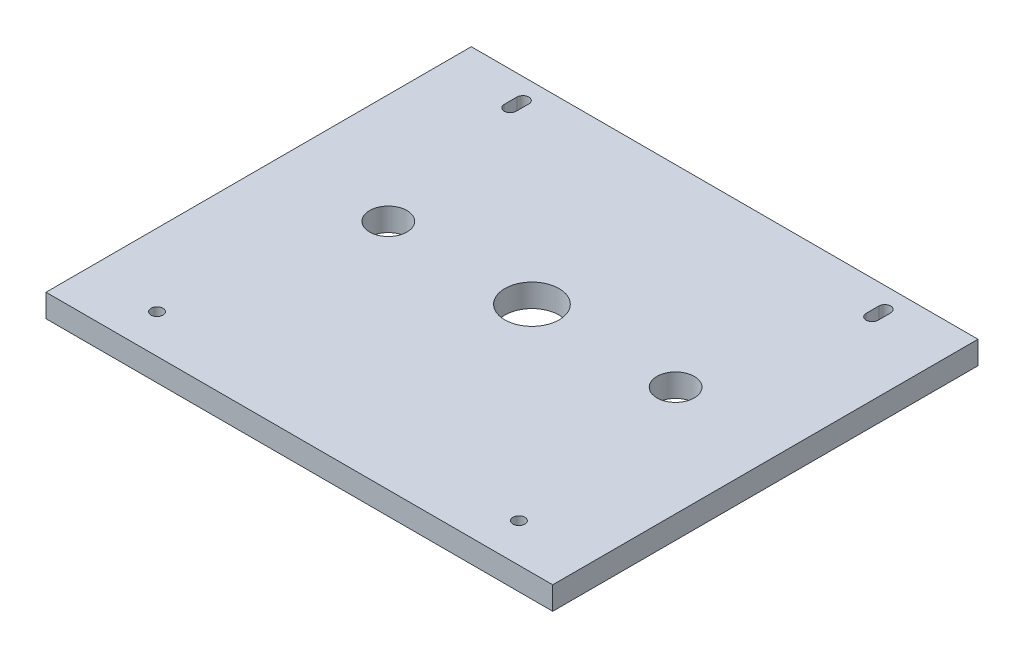
ISO-10303-21;
HEADER;
FILE_DESCRIPTION(('STEP AP214'),'2;1');
FILE_NAME('part.step','',(''),(''),'','','');
FILE_SCHEMA(('AUTOMOTIVE_DESIGN { 1 0 10303 214 1 1 1 1 }'));
ENDSEC;
DATA;
#1=APPLICATION_CONTEXT('core data for automotive mechanical design processes');
#2=APPLICATION_PROTOCOL_DEFINITION('international standard','automotive_design',2000,#1);
#3=PRODUCT_CONTEXT('',#1,'mechanical');
#4=PRODUCT('Part','Part','',(#3));
#5=PRODUCT_RELATED_PRODUCT_CATEGORY('part','',(#4));
#6=PRODUCT_DEFINITION_FORMATION('','',#4);
#7=PRODUCT_DEFINITION_CONTEXT('part definition',#1,'design');
#8=PRODUCT_DEFINITION('design','',#6,#7);
#9=PRODUCT_DEFINITION_SHAPE('','',#8);
#10=(LENGTH_UNIT() NAMED_UNIT(*) SI_UNIT(.MILLI.,.METRE.));
#11=(NAMED_UNIT(*) PLANE_ANGLE_UNIT() SI_UNIT($,.RADIAN.));
#12=(NAMED_UNIT(*) SI_UNIT($,.STERADIAN.) SOLID_ANGLE_UNIT());
#13=UNCERTAINTY_MEASURE_WITH_UNIT(LENGTH_MEASURE(1.E-05),#10,'distance_accuracy_value','');
#14=(GEOMETRIC_REPRESENTATION_CONTEXT(3) GLOBAL_UNCERTAINTY_ASSIGNED_CONTEXT((#13)) GLOBAL_UNIT_ASSIGNED_CONTEXT((#10,
#11,#12)) REPRESENTATION_CONTEXT('',''));
#15=CARTESIAN_POINT('',(0.,0.,0.));
#16=DIRECTION('',(0.,0.,1.));
#17=DIRECTION('',(1.,0.,0.));
#18=AXIS2_PLACEMENT_3D('',#15,#16,#17);
#19=CARTESIAN_POINT('',(0.,6.35,0.));
#20=DIRECTION('',(1.,0.,0.));
#21=DIRECTION('',(0.,0.,-1.));
#22=AXIS2_PLACEMENT_3D('',#19,#20,#21);
#23=PLANE('',#22);
#24=DIRECTION('',(0.,0.,1.));
#25=VECTOR('',#24,1.);
#26=CARTESIAN_POINT('',(0.,0.,0.));
#27=LINE('',#26,#25);
#28=CARTESIAN_POINT('',(0.,0.,-117.505));
#29=VERTEX_POINT('',#28);
#30=CARTESIAN_POINT('',(0.,0.,0.));
#31=VERTEX_POINT('',#30);
#32=EDGE_CURVE('E222',#29,#31,#27,.T.);
#33=ORIENTED_EDGE('',*,*,#32,.T.);
#34=DIRECTION('',(0.,-1.,0.));
#35=VECTOR('',#34,1.);
#36=CARTESIAN_POINT('',(0.,6.35,0.));
#37=LINE('',#36,#35);
#38=CARTESIAN_POINT('',(0.,6.35,0.));
#39=VERTEX_POINT('',#38);
#40=EDGE_CURVE('E11',#39,#31,#37,.T.);
#41=ORIENTED_EDGE('',*,*,#40,.F.);
#42=DIRECTION('',(0.,0.,1.));
#43=VECTOR('',#42,1.);
#44=CARTESIAN_POINT('',(0.,6.35,0.));
#45=LINE('',#44,#43);
#46=CARTESIAN_POINT('',(0.,6.35,-117.505));
#47=VERTEX_POINT('',#46);
#48=EDGE_CURVE('E225',#47,#39,#45,.T.);
#49=ORIENTED_EDGE('',*,*,#48,.F.);
#50=DIRECTION('',(0.,-1.,0.));
#51=VECTOR('',#50,1.);
#52=CARTESIAN_POINT('',(0.,6.35,-117.505));
#53=LINE('',#52,#51);
#54=EDGE_CURVE('E235',#47,#29,#53,.T.);
#55=ORIENTED_EDGE('',*,*,#54,.T.);
#56=EDGE_LOOP('',(#33,#41,#49,#55));
#57=FACE_BOUND('',#56,.T.);
#58=ADVANCED_FACE('F41',(#57),#23,.F.);
#59=CARTESIAN_POINT('',(0.,6.35,0.));
#60=DIRECTION('',(0.,0.,-1.));
#61=DIRECTION('',(-1.,0.,0.));
#62=AXIS2_PLACEMENT_3D('',#59,#60,#61);
#63=PLANE('',#62);
#64=DIRECTION('',(1.,0.,0.));
#65=VECTOR('',#64,1.);
#66=CARTESIAN_POINT('',(0.,0.,0.));
#67=LINE('',#66,#65);
#68=CARTESIAN_POINT('',(140.,0.,0.));
#69=VERTEX_POINT('',#68);
#70=EDGE_CURVE('E238',#31,#69,#67,.T.);
#71=ORIENTED_EDGE('',*,*,#70,.T.);
#72=DIRECTION('',(0.,-1.,0.));
#73=VECTOR('',#72,1.);
#74=CARTESIAN_POINT('',(140.,6.35,0.));
#75=LINE('',#74,#73);
#76=CARTESIAN_POINT('',(140.,6.35,0.));
#77=VERTEX_POINT('',#76);
#78=EDGE_CURVE('E48',#77,#69,#75,.T.);
#79=ORIENTED_EDGE('',*,*,#78,.F.);
#80=DIRECTION('',(1.,0.,0.));
#81=VECTOR('',#80,1.);
#82=CARTESIAN_POINT('',(0.,6.35,0.));
#83=LINE('',#82,#81);
#84=EDGE_CURVE('E228',#39,#77,#83,.T.);
#85=ORIENTED_EDGE('',*,*,#84,.F.);
#86=ORIENTED_EDGE('',*,*,#40,.T.);
#87=EDGE_LOOP('',(#71,#79,#85,#86));
#88=FACE_BOUND('',#87,.T.);
#89=ADVANCED_FACE('F267',(#88),#63,.F.);
#90=CARTESIAN_POINT('',(140.,6.35,0.));
#91=DIRECTION('',(-1.,0.,0.));
#92=DIRECTION('',(0.,0.,1.));
#93=AXIS2_PLACEMENT_3D('',#90,#91,#92);
#94=PLANE('',#93);
#95=DIRECTION('',(0.,0.,-1.));
#96=VECTOR('',#95,1.);
#97=CARTESIAN_POINT('',(140.,0.,0.));
#98=LINE('',#97,#96);
#99=CARTESIAN_POINT('',(140.,0.,-117.505));
#100=VERTEX_POINT('',#99);
#101=EDGE_CURVE('E240',#69,#100,#98,.T.);
#102=ORIENTED_EDGE('',*,*,#101,.T.);
#103=DIRECTION('',(0.,-1.,0.));
#104=VECTOR('',#103,1.);
#105=CARTESIAN_POINT('',(140.,6.35,-117.505));
#106=LINE('',#105,#104);
#107=CARTESIAN_POINT('',(140.,6.35,-117.505));
#108=VERTEX_POINT('',#107);
#109=EDGE_CURVE('E245',#108,#100,#106,.T.);
#110=ORIENTED_EDGE('',*,*,#109,.F.);
#111=DIRECTION('',(0.,0.,-1.));
#112=VECTOR('',#111,1.);
#113=CARTESIAN_POINT('',(140.,6.35,0.));
#114=LINE('',#113,#112);
#115=EDGE_CURVE('E231',#77,#108,#114,.T.);
#116=ORIENTED_EDGE('',*,*,#115,.F.);
#117=ORIENTED_EDGE('',*,*,#78,.T.);
#118=EDGE_LOOP('',(#102,#110,#116,#117));
#119=FACE_BOUND('',#118,.T.);
#120=ADVANCED_FACE('F252',(#119),#94,.F.);
#121=CARTESIAN_POINT('',(0.,6.35,-117.505));
#122=DIRECTION('',(0.,0.,1.));
#123=DIRECTION('',(1.,0.,0.));
#124=AXIS2_PLACEMENT_3D('',#121,#122,#123);
#125=PLANE('',#124);
#126=DIRECTION('',(-1.,0.,0.));
#127=VECTOR('',#126,1.);
#128=CARTESIAN_POINT('',(0.,0.,-117.505));
#129=LINE('',#128,#127);
#130=EDGE_CURVE('E229',#100,#29,#129,.T.);
#131=ORIENTED_EDGE('',*,*,#130,.T.);
#132=ORIENTED_EDGE('',*,*,#54,.F.);
#133=DIRECTION('',(-1.,0.,0.));
#134=VECTOR('',#133,1.);
#135=CARTESIAN_POINT('',(0.,6.35,-117.505));
#136=LINE('',#135,#134);
#137=EDGE_CURVE('E233',#108,#47,#136,.T.);
#138=ORIENTED_EDGE('',*,*,#137,.F.);
#139=ORIENTED_EDGE('',*,*,#109,.T.);
#140=EDGE_LOOP('',(#131,#132,#138,#139));
#141=FACE_BOUND('',#140,.T.);
#142=ADVANCED_FACE('F261',(#141),#125,.F.);
#143=CARTESIAN_POINT('',(0.,6.35,0.));
#144=DIRECTION('',(0.,-1.,0.));
#145=DIRECTION('',(0.,0.,-1.));
#146=AXIS2_PLACEMENT_3D('',#143,#144,#145);
#147=PLANE('',#146);
#148=DIRECTION('',(0.,0.,-1.));
#149=VECTOR('',#148,1.);
#150=CARTESIAN_POINT('',(121.65,6.35,-108.255));
#151=LINE('',#150,#149);
#152=CARTESIAN_POINT('',(121.65,6.35,-108.255));
#153=VERTEX_POINT('',#152);
#154=CARTESIAN_POINT('',(121.65,6.35,-111.755));
#155=VERTEX_POINT('',#154);
#156=EDGE_CURVE('E193',#153,#155,#151,.T.);
#157=ORIENTED_EDGE('',*,*,#156,.F.);
#158=CARTESIAN_POINT('',(120.,6.35,-108.255));
#159=DIRECTION('',(0.,1.,0.));
#160=DIRECTION('',(0.,0.,-1.));
#161=AXIS2_PLACEMENT_3D('',#158,#159,#160);
#162=CIRCLE('',#161,1.65);
#163=CARTESIAN_POINT('',(118.35,6.35,-108.255));
#164=VERTEX_POINT('',#163);
#165=EDGE_CURVE('E55',#164,#153,#162,.T.);
#166=ORIENTED_EDGE('',*,*,#165,.F.);
#167=DIRECTION('',(0.,0.,1.));
#168=VECTOR('',#167,1.);
#169=CARTESIAN_POINT('',(118.35,6.35,-108.255));
#170=LINE('',#169,#168);
#171=CARTESIAN_POINT('',(118.35,6.35,-111.755));
#172=VERTEX_POINT('',#171);
#173=EDGE_CURVE('E186',#172,#164,#170,.T.);
#174=ORIENTED_EDGE('',*,*,#173,.F.);
#175=CARTESIAN_POINT('',(120.,6.35,-111.755));
#176=DIRECTION('',(0.,1.,0.));
#177=DIRECTION('',(0.,0.,-1.));
#178=AXIS2_PLACEMENT_3D('',#175,#176,#177);
#179=CIRCLE('',#178,1.65);
#180=EDGE_CURVE('E189',#155,#172,#179,.T.);
#181=ORIENTED_EDGE('',*,*,#180,.F.);
#182=EDGE_LOOP('',(#157,#166,#174,#181));
#183=FACE_BOUND('',#182,.T.);
#184=CARTESIAN_POINT('',(109.6875,6.35,-64.265));
#185=DIRECTION('',(0.,1.,0.));
#186=DIRECTION('',(0.,0.,-1.));
#187=AXIS2_PLACEMENT_3D('',#184,#185,#186);
#188=CIRCLE('',#187,5.16000000000002);
#189=CARTESIAN_POINT('',(109.6875,6.35,-69.425));
#190=VERTEX_POINT('',#189);
#191=EDGE_CURVE('E173',#190,#190,#188,.T.);
#192=ORIENTED_EDGE('',*,*,#191,.F.);
#193=EDGE_LOOP('',(#192));
#194=FACE_BOUND('',#193,.T.);
#195=CARTESIAN_POINT('',(120.,6.35,-10.675));
#196=DIRECTION('',(0.,1.,0.));
#197=DIRECTION('',(0.,0.,-1.));
#198=AXIS2_PLACEMENT_3D('',#195,#196,#197);
#199=CIRCLE('',#198,1.65);
#200=CARTESIAN_POINT('',(120.,6.35,-12.325));
#201=VERTEX_POINT('',#200);
#202=EDGE_CURVE('E214',#201,#201,#199,.T.);
#203=ORIENTED_EDGE('',*,*,#202,.F.);
#204=EDGE_LOOP('',(#203));
#205=FACE_BOUND('',#204,.T.);
#206=CARTESIAN_POINT('',(30.3125,6.35,-64.265));
#207=DIRECTION('',(0.,1.,0.));
#208=DIRECTION('',(0.,0.,1.));
#209=AXIS2_PLACEMENT_3D('',#206,#207,#208);
#210=CIRCLE('',#209,5.16000000000001);
#211=CARTESIAN_POINT('',(30.3125,6.35,-59.105));
#212=VERTEX_POINT('',#211);
#213=EDGE_CURVE('E207',#212,#212,#210,.T.);
#214=ORIENTED_EDGE('',*,*,#213,.F.);
#215=EDGE_LOOP('',(#214));
#216=FACE_BOUND('',#215,.T.);
#217=DIRECTION('',(0.,0.,-1.));
#218=VECTOR('',#217,1.);
#219=CARTESIAN_POINT('',(21.6499999999999,6.35,-108.255));
#220=LINE('',#219,#218);
#221=CARTESIAN_POINT('',(21.6499999999999,6.35,-108.255));
#222=VERTEX_POINT('',#221);
#223=CARTESIAN_POINT('',(21.6499999999999,6.35,-111.755));
#224=VERTEX_POINT('',#223);
#225=EDGE_CURVE('E150',#222,#224,#220,.T.);
#226=ORIENTED_EDGE('',*,*,#225,.F.);
#227=CARTESIAN_POINT('',(19.9999999999999,6.35,-108.255));
#228=DIRECTION('',(0.,1.,0.));
#229=DIRECTION('',(0.,0.,1.));
#230=AXIS2_PLACEMENT_3D('',#227,#228,#229);
#231=CIRCLE('',#230,1.65);
#232=CARTESIAN_POINT('',(18.3499999999999,6.35,-108.255));
#233=VERTEX_POINT('',#232);
#234=EDGE_CURVE('E63',#233,#222,#231,.T.);
#235=ORIENTED_EDGE('',*,*,#234,.F.);
#236=DIRECTION('',(0.,0.,1.));
#237=VECTOR('',#236,1.);
#238=CARTESIAN_POINT('',(18.3499999999999,6.35,-108.255));
#239=LINE('',#238,#237);
#240=CARTESIAN_POINT('',(18.3499999999999,6.35,-111.755));
#241=VERTEX_POINT('',#240);
#242=EDGE_CURVE('E139',#241,#233,#239,.T.);
#243=ORIENTED_EDGE('',*,*,#242,.F.);
#244=CARTESIAN_POINT('',(19.9999999999999,6.35,-111.755));
#245=DIRECTION('',(0.,1.,0.));
#246=DIRECTION('',(0.,0.,1.));
#247=AXIS2_PLACEMENT_3D('',#244,#245,#246);
#248=CIRCLE('',#247,1.65);
#249=EDGE_CURVE('E144',#224,#241,#248,.T.);
#250=ORIENTED_EDGE('',*,*,#249,.F.);
#251=EDGE_LOOP('',(#226,#235,#243,#250));
#252=FACE_BOUND('',#251,.T.);
#253=CARTESIAN_POINT('',(70.,6.35,-64.265));
#254=DIRECTION('',(0.,1.,0.));
#255=DIRECTION('',(0.,0.,1.));
#256=AXIS2_PLACEMENT_3D('',#253,#254,#255);
#257=CIRCLE('',#256,7.50000000000001);
#258=CARTESIAN_POINT('',(70.,6.35,-56.765));
#259=VERTEX_POINT('',#258);
#260=EDGE_CURVE('E136',#259,#259,#257,.T.);
#261=ORIENTED_EDGE('',*,*,#260,.F.);
#262=EDGE_LOOP('',(#261));
#263=FACE_BOUND('',#262,.T.);
#264=CARTESIAN_POINT('',(20.,6.35,-10.675));
#265=DIRECTION('',(0.,1.,0.));
#266=DIRECTION('',(0.,0.,1.));
#267=AXIS2_PLACEMENT_3D('',#264,#265,#266);
#268=CIRCLE('',#267,1.65);
#269=CARTESIAN_POINT('',(20.,6.35,-9.025));
#270=VERTEX_POINT('',#269);
#271=EDGE_CURVE('E210',#270,#270,#268,.T.);
#272=ORIENTED_EDGE('',*,*,#271,.F.);
#273=EDGE_LOOP('',(#272));
#274=FACE_BOUND('',#273,.T.);
#275=ORIENTED_EDGE('',*,*,#48,.T.);
#276=ORIENTED_EDGE('',*,*,#84,.T.);
#277=ORIENTED_EDGE('',*,*,#115,.T.);
#278=ORIENTED_EDGE('',*,*,#137,.T.);
#279=EDGE_LOOP('',(#275,#276,#277,#278));
#280=FACE_BOUND('',#279,.T.);
#281=ADVANCED_FACE('F147',(#183,#194,#205,#216,#252,#263,#274,#280),#147,.F.);
#282=CARTESIAN_POINT('',(0.,0.,0.));
#283=DIRECTION('',(0.,-1.,0.));
#284=DIRECTION('',(0.,0.,-1.));
#285=AXIS2_PLACEMENT_3D('',#282,#283,#284);
#286=PLANE('',#285);
#287=CARTESIAN_POINT('',(120.,0.,-108.255));
#288=DIRECTION('',(0.,1.,0.));
#289=DIRECTION('',(0.,0.,-1.));
#290=AXIS2_PLACEMENT_3D('',#287,#288,#289);
#291=CIRCLE('',#290,1.65);
#292=CARTESIAN_POINT('',(118.35,0.,-108.255));
#293=VERTEX_POINT('',#292);
#294=CARTESIAN_POINT('',(121.65,0.,-108.255));
#295=VERTEX_POINT('',#294);
#296=EDGE_CURVE('E190',#293,#295,#291,.T.);
#297=ORIENTED_EDGE('',*,*,#296,.T.);
#298=DIRECTION('',(0.,0.,-1.));
#299=VECTOR('',#298,1.);
#300=CARTESIAN_POINT('',(121.65,0.,-108.255));
#301=LINE('',#300,#299);
#302=CARTESIAN_POINT('',(121.65,0.,-111.755));
#303=VERTEX_POINT('',#302);
#304=EDGE_CURVE('E202',#295,#303,#301,.T.);
#305=ORIENTED_EDGE('',*,*,#304,.T.);
#306=CARTESIAN_POINT('',(120.,0.,-111.755));
#307=DIRECTION('',(0.,1.,0.));
#308=DIRECTION('',(0.,0.,-1.));
#309=AXIS2_PLACEMENT_3D('',#306,#307,#308);
#310=CIRCLE('',#309,1.65);
#311=CARTESIAN_POINT('',(118.35,0.,-111.755));
#312=VERTEX_POINT('',#311);
#313=EDGE_CURVE('E199',#303,#312,#310,.T.);
#314=ORIENTED_EDGE('',*,*,#313,.T.);
#315=DIRECTION('',(0.,0.,1.));
#316=VECTOR('',#315,1.);
#317=CARTESIAN_POINT('',(118.35,0.,-108.255));
#318=LINE('',#317,#316);
#319=EDGE_CURVE('E182',#312,#293,#318,.T.);
#320=ORIENTED_EDGE('',*,*,#319,.T.);
#321=EDGE_LOOP('',(#297,#305,#314,#320));
#322=FACE_BOUND('',#321,.T.);
#323=CARTESIAN_POINT('',(109.6875,0.,-64.265));
#324=DIRECTION('',(0.,1.,0.));
#325=DIRECTION('',(0.,0.,-1.));
#326=AXIS2_PLACEMENT_3D('',#323,#324,#325);
#327=CIRCLE('',#326,5.16000000000002);
#328=CARTESIAN_POINT('',(109.6875,0.,-69.425));
#329=VERTEX_POINT('',#328);
#330=EDGE_CURVE('E177',#329,#329,#327,.T.);
#331=ORIENTED_EDGE('',*,*,#330,.T.);
#332=EDGE_LOOP('',(#331));
#333=FACE_BOUND('',#332,.T.);
#334=CARTESIAN_POINT('',(120.,0.,-10.675));
#335=DIRECTION('',(0.,1.,0.));
#336=DIRECTION('',(0.,0.,-1.));
#337=AXIS2_PLACEMENT_3D('',#334,#335,#336);
#338=CIRCLE('',#337,1.65);
#339=CARTESIAN_POINT('',(120.,0.,-12.325));
#340=VERTEX_POINT('',#339);
#341=EDGE_CURVE('E176',#340,#340,#338,.T.);
#342=ORIENTED_EDGE('',*,*,#341,.T.);
#343=EDGE_LOOP('',(#342));
#344=FACE_BOUND('',#343,.T.);
#345=CARTESIAN_POINT('',(30.3125,0.,-64.265));
#346=DIRECTION('',(0.,1.,0.));
#347=DIRECTION('',(0.,0.,1.));
#348=AXIS2_PLACEMENT_3D('',#345,#346,#347);
#349=CIRCLE('',#348,5.16000000000001);
#350=CARTESIAN_POINT('',(30.3125,0.,-59.105));
#351=VERTEX_POINT('',#350);
#352=EDGE_CURVE('E211',#351,#351,#349,.T.);
#353=ORIENTED_EDGE('',*,*,#352,.T.);
#354=EDGE_LOOP('',(#353));
#355=FACE_BOUND('',#354,.T.);
#356=CARTESIAN_POINT('',(19.9999999999999,0.,-108.255));
#357=DIRECTION('',(0.,1.,0.));
#358=DIRECTION('',(0.,0.,1.));
#359=AXIS2_PLACEMENT_3D('',#356,#357,#358);
#360=CIRCLE('',#359,1.65);
#361=CARTESIAN_POINT('',(18.3499999999999,0.,-108.255));
#362=VERTEX_POINT('',#361);
#363=CARTESIAN_POINT('',(21.6499999999999,0.,-108.255));
#364=VERTEX_POINT('',#363);
#365=EDGE_CURVE('E131',#362,#364,#360,.T.);
#366=ORIENTED_EDGE('',*,*,#365,.T.);
#367=DIRECTION('',(0.,0.,-1.));
#368=VECTOR('',#367,1.);
#369=CARTESIAN_POINT('',(21.6499999999999,0.,-108.255));
#370=LINE('',#369,#368);
#371=CARTESIAN_POINT('',(21.6499999999999,0.,-111.755));
#372=VERTEX_POINT('',#371);
#373=EDGE_CURVE('E164',#364,#372,#370,.T.);
#374=ORIENTED_EDGE('',*,*,#373,.T.);
#375=CARTESIAN_POINT('',(19.9999999999999,0.,-111.755));
#376=DIRECTION('',(0.,1.,0.));
#377=DIRECTION('',(0.,0.,1.));
#378=AXIS2_PLACEMENT_3D('',#375,#376,#377);
#379=CIRCLE('',#378,1.65);
#380=CARTESIAN_POINT('',(18.3499999999999,0.,-111.755));
#381=VERTEX_POINT('',#380);
#382=EDGE_CURVE('E160',#372,#381,#379,.T.);
#383=ORIENTED_EDGE('',*,*,#382,.T.);
#384=DIRECTION('',(0.,0.,1.));
#385=VECTOR('',#384,1.);
#386=CARTESIAN_POINT('',(18.3499999999999,0.,-108.255));
#387=LINE('',#386,#385);
#388=EDGE_CURVE('E158',#381,#362,#387,.T.);
#389=ORIENTED_EDGE('',*,*,#388,.T.);
#390=EDGE_LOOP('',(#366,#374,#383,#389));
#391=FACE_BOUND('',#390,.T.);
#392=CARTESIAN_POINT('',(70.,0.,-64.265));
#393=DIRECTION('',(0.,1.,0.));
#394=DIRECTION('',(0.,0.,1.));
#395=AXIS2_PLACEMENT_3D('',#392,#393,#394);
#396=CIRCLE('',#395,7.50000000000001);
#397=CARTESIAN_POINT('',(70.,0.,-56.765));
#398=VERTEX_POINT('',#397);
#399=EDGE_CURVE('E170',#398,#398,#396,.T.);
#400=ORIENTED_EDGE('',*,*,#399,.T.);
#401=EDGE_LOOP('',(#400));
#402=FACE_BOUND('',#401,.T.);
#403=CARTESIAN_POINT('',(20.,0.,-10.675));
#404=DIRECTION('',(0.,1.,0.));
#405=DIRECTION('',(0.,0.,1.));
#406=AXIS2_PLACEMENT_3D('',#403,#404,#405);
#407=CIRCLE('',#406,1.65);
#408=CARTESIAN_POINT('',(20.,0.,-9.025));
#409=VERTEX_POINT('',#408);
#410=EDGE_CURVE('E219',#409,#409,#407,.T.);
#411=ORIENTED_EDGE('',*,*,#410,.T.);
#412=EDGE_LOOP('',(#411));
#413=FACE_BOUND('',#412,.T.);
#414=ORIENTED_EDGE('',*,*,#32,.F.);
#415=ORIENTED_EDGE('',*,*,#130,.F.);
#416=ORIENTED_EDGE('',*,*,#101,.F.);
#417=ORIENTED_EDGE('',*,*,#70,.F.);
#418=EDGE_LOOP('',(#414,#415,#416,#417));
#419=FACE_BOUND('',#418,.T.);
#420=ADVANCED_FACE('F258',(#322,#333,#344,#355,#391,#402,#413,#419),#286,.T.);
#421=CARTESIAN_POINT('',(20.,0.,-10.675));
#422=DIRECTION('',(0.,1.,0.));
#423=DIRECTION('',(0.,0.,1.));
#424=AXIS2_PLACEMENT_3D('',#421,#422,#423);
#425=CYLINDRICAL_SURFACE('',#424,1.65);
#426=ORIENTED_EDGE('',*,*,#410,.F.);
#427=EDGE_LOOP('',(#426));
#428=FACE_BOUND('',#427,.T.);
#429=ORIENTED_EDGE('',*,*,#271,.T.);
#430=EDGE_LOOP('',(#429));
#431=FACE_BOUND('',#430,.T.);
#432=ADVANCED_FACE('F279',(#428,#431),#425,.F.);
#433=CARTESIAN_POINT('',(70.,0.,-64.265));
#434=DIRECTION('',(0.,1.,0.));
#435=DIRECTION('',(0.,0.,1.));
#436=AXIS2_PLACEMENT_3D('',#433,#434,#435);
#437=CYLINDRICAL_SURFACE('',#436,7.50000000000001);
#438=ORIENTED_EDGE('',*,*,#399,.F.);
#439=EDGE_LOOP('',(#438));
#440=FACE_BOUND('',#439,.T.);
#441=ORIENTED_EDGE('',*,*,#260,.T.);
#442=EDGE_LOOP('',(#441));
#443=FACE_BOUND('',#442,.T.);
#444=ADVANCED_FACE('F286',(#440,#443),#437,.F.);
#445=CARTESIAN_POINT('',(19.9999999999999,0.,-108.255));
#446=DIRECTION('',(0.,1.,0.));
#447=DIRECTION('',(0.,0.,1.));
#448=AXIS2_PLACEMENT_3D('',#445,#446,#447);
#449=CYLINDRICAL_SURFACE('',#448,1.65);
#450=ORIENTED_EDGE('',*,*,#234,.T.);
#451=DIRECTION('',(0.,1.,0.));
#452=VECTOR('',#451,1.);
#453=CARTESIAN_POINT('',(21.6499999999999,0.,-108.255));
#454=LINE('',#453,#452);
#455=EDGE_CURVE('E161',#364,#222,#454,.T.);
#456=ORIENTED_EDGE('',*,*,#455,.F.);
#457=ORIENTED_EDGE('',*,*,#365,.F.);
#458=DIRECTION('',(0.,1.,0.));
#459=VECTOR('',#458,1.);
#460=CARTESIAN_POINT('',(18.3499999999999,0.,-108.255));
#461=LINE('',#460,#459);
#462=EDGE_CURVE('E127',#362,#233,#461,.T.);
#463=ORIENTED_EDGE('',*,*,#462,.T.);
#464=EDGE_LOOP('',(#450,#456,#457,#463));
#465=FACE_BOUND('',#464,.T.);
#466=ADVANCED_FACE('F129',(#465),#449,.F.);
#467=CARTESIAN_POINT('',(18.3499999999999,0.,-108.255));
#468=DIRECTION('',(-1.,0.,0.));
#469=DIRECTION('',(0.,0.,1.));
#470=AXIS2_PLACEMENT_3D('',#467,#468,#469);
#471=PLANE('',#470);
#472=ORIENTED_EDGE('',*,*,#242,.T.);
#473=ORIENTED_EDGE('',*,*,#462,.F.);
#474=ORIENTED_EDGE('',*,*,#388,.F.);
#475=DIRECTION('',(0.,1.,0.));
#476=VECTOR('',#475,1.);
#477=CARTESIAN_POINT('',(18.3499999999999,0.,-111.755));
#478=LINE('',#477,#476);
#479=EDGE_CURVE('E135',#381,#241,#478,.T.);
#480=ORIENTED_EDGE('',*,*,#479,.T.);
#481=EDGE_LOOP('',(#472,#473,#474,#480));
#482=FACE_BOUND('',#481,.T.);
#483=ADVANCED_FACE('F140',(#482),#471,.F.);
#484=CARTESIAN_POINT('',(19.9999999999999,0.,-111.755));
#485=DIRECTION('',(0.,1.,0.));
#486=DIRECTION('',(0.,0.,1.));
#487=AXIS2_PLACEMENT_3D('',#484,#485,#486);
#488=CYLINDRICAL_SURFACE('',#487,1.65);
#489=ORIENTED_EDGE('',*,*,#249,.T.);
#490=ORIENTED_EDGE('',*,*,#479,.F.);
#491=ORIENTED_EDGE('',*,*,#382,.F.);
#492=DIRECTION('',(0.,1.,0.));
#493=VECTOR('',#492,1.);
#494=CARTESIAN_POINT('',(21.6499999999999,0.,-111.755));
#495=LINE('',#494,#493);
#496=EDGE_CURVE('E443',#372,#224,#495,.T.);
#497=ORIENTED_EDGE('',*,*,#496,.T.);
#498=EDGE_LOOP('',(#489,#490,#491,#497));
#499=FACE_BOUND('',#498,.T.);
#500=ADVANCED_FACE('F321',(#499),#488,.F.);
#501=CARTESIAN_POINT('',(21.6499999999999,0.,-108.255));
#502=DIRECTION('',(1.,0.,0.));
#503=DIRECTION('',(0.,0.,-1.));
#504=AXIS2_PLACEMENT_3D('',#501,#502,#503);
#505=PLANE('',#504);
#506=ORIENTED_EDGE('',*,*,#225,.T.);
#507=ORIENTED_EDGE('',*,*,#496,.F.);
#508=ORIENTED_EDGE('',*,*,#373,.F.);
#509=ORIENTED_EDGE('',*,*,#455,.T.);
#510=EDGE_LOOP('',(#506,#507,#508,#509));
#511=FACE_BOUND('',#510,.T.);
#512=ADVANCED_FACE('F296',(#511),#505,.F.);
#513=CARTESIAN_POINT('',(30.3125,0.,-64.265));
#514=DIRECTION('',(0.,1.,0.));
#515=DIRECTION('',(0.,0.,1.));
#516=AXIS2_PLACEMENT_3D('',#513,#514,#515);
#517=CYLINDRICAL_SURFACE('',#516,5.16000000000001);
#518=ORIENTED_EDGE('',*,*,#352,.F.);
#519=EDGE_LOOP('',(#518));
#520=FACE_BOUND('',#519,.T.);
#521=ORIENTED_EDGE('',*,*,#213,.T.);
#522=EDGE_LOOP('',(#521));
#523=FACE_BOUND('',#522,.T.);
#524=ADVANCED_FACE('F292',(#520,#523),#517,.F.);
#525=CARTESIAN_POINT('',(120.,0.,-10.675));
#526=DIRECTION('',(0.,1.,0.));
#527=DIRECTION('',(0.,0.,1.));
#528=AXIS2_PLACEMENT_3D('',#525,#526,#527);
#529=CYLINDRICAL_SURFACE('',#528,1.65);
#530=ORIENTED_EDGE('',*,*,#341,.F.);
#531=EDGE_LOOP('',(#530));
#532=FACE_BOUND('',#531,.T.);
#533=ORIENTED_EDGE('',*,*,#202,.T.);
#534=EDGE_LOOP('',(#533));
#535=FACE_BOUND('',#534,.T.);
#536=ADVANCED_FACE('F288',(#532,#535),#529,.F.);
#537=CARTESIAN_POINT('',(109.6875,0.,-64.265));
#538=DIRECTION('',(0.,1.,0.));
#539=DIRECTION('',(0.,0.,1.));
#540=AXIS2_PLACEMENT_3D('',#537,#538,#539);
#541=CYLINDRICAL_SURFACE('',#540,5.16000000000002);
#542=ORIENTED_EDGE('',*,*,#330,.F.);
#543=EDGE_LOOP('',(#542));
#544=FACE_BOUND('',#543,.T.);
#545=ORIENTED_EDGE('',*,*,#191,.T.);
#546=EDGE_LOOP('',(#545));
#547=FACE_BOUND('',#546,.T.);
#548=ADVANCED_FACE('F291',(#544,#547),#541,.F.);
#549=CARTESIAN_POINT('',(120.,0.,-108.255));
#550=DIRECTION('',(0.,1.,0.));
#551=DIRECTION('',(0.,0.,1.));
#552=AXIS2_PLACEMENT_3D('',#549,#550,#551);
#553=CYLINDRICAL_SURFACE('',#552,1.65);
#554=ORIENTED_EDGE('',*,*,#165,.T.);
#555=DIRECTION('',(0.,1.,0.));
#556=VECTOR('',#555,1.);
#557=CARTESIAN_POINT('',(121.65,0.,-108.255));
#558=LINE('',#557,#556);
#559=EDGE_CURVE('E180',#295,#153,#558,.T.);
#560=ORIENTED_EDGE('',*,*,#559,.F.);
#561=ORIENTED_EDGE('',*,*,#296,.F.);
#562=DIRECTION('',(0.,1.,0.));
#563=VECTOR('',#562,1.);
#564=CARTESIAN_POINT('',(118.35,0.,-108.255));
#565=LINE('',#564,#563);
#566=EDGE_CURVE('E151',#293,#164,#565,.T.);
#567=ORIENTED_EDGE('',*,*,#566,.T.);
#568=EDGE_LOOP('',(#554,#560,#561,#567));
#569=FACE_BOUND('',#568,.T.);
#570=ADVANCED_FACE('F302',(#569),#553,.F.);
#571=CARTESIAN_POINT('',(118.35,0.,-108.255));
#572=DIRECTION('',(-1.,0.,0.));
#573=DIRECTION('',(0.,0.,1.));
#574=AXIS2_PLACEMENT_3D('',#571,#572,#573);
#575=PLANE('',#574);
#576=ORIENTED_EDGE('',*,*,#173,.T.);
#577=ORIENTED_EDGE('',*,*,#566,.F.);
#578=ORIENTED_EDGE('',*,*,#319,.F.);
#579=DIRECTION('',(0.,1.,0.));
#580=VECTOR('',#579,1.);
#581=CARTESIAN_POINT('',(118.35,0.,-111.755));
#582=LINE('',#581,#580);
#583=EDGE_CURVE('E153',#312,#172,#582,.T.);
#584=ORIENTED_EDGE('',*,*,#583,.T.);
#585=EDGE_LOOP('',(#576,#577,#578,#584));
#586=FACE_BOUND('',#585,.T.);
#587=ADVANCED_FACE('F298',(#586),#575,.F.);
#588=CARTESIAN_POINT('',(120.,0.,-111.755));
#589=DIRECTION('',(0.,1.,0.));
#590=DIRECTION('',(0.,0.,1.));
#591=AXIS2_PLACEMENT_3D('',#588,#589,#590);
#592=CYLINDRICAL_SURFACE('',#591,1.65);
#593=ORIENTED_EDGE('',*,*,#180,.T.);
#594=ORIENTED_EDGE('',*,*,#583,.F.);
#595=ORIENTED_EDGE('',*,*,#313,.F.);
#596=DIRECTION('',(0.,1.,0.));
#597=VECTOR('',#596,1.);
#598=CARTESIAN_POINT('',(121.65,0.,-111.755));
#599=LINE('',#598,#597);
#600=EDGE_CURVE('E183',#303,#155,#599,.T.);
#601=ORIENTED_EDGE('',*,*,#600,.T.);
#602=EDGE_LOOP('',(#593,#594,#595,#601));
#603=FACE_BOUND('',#602,.T.);
#604=ADVANCED_FACE('F301',(#603),#592,.F.);
#605=CARTESIAN_POINT('',(121.65,0.,-108.255));
#606=DIRECTION('',(1.,0.,0.));
#607=DIRECTION('',(0.,0.,-1.));
#608=AXIS2_PLACEMENT_3D('',#605,#606,#607);
#609=PLANE('',#608);
#610=ORIENTED_EDGE('',*,*,#156,.T.);
#611=ORIENTED_EDGE('',*,*,#600,.F.);
#612=ORIENTED_EDGE('',*,*,#304,.F.);
#613=ORIENTED_EDGE('',*,*,#559,.T.);
#614=EDGE_LOOP('',(#610,#611,#612,#613));
#615=FACE_BOUND('',#614,.T.);
#616=ADVANCED_FACE('F306',(#615),#609,.F.);
#617=CLOSED_SHELL('',(#58,#89,#120,#142,#281,#420,#432,#444,#466,#483,#500,#512,#524,#536,#548,
#570,#587,#604,#616));
#618=MANIFOLD_SOLID_BREP('B2',#617);
#619=ADVANCED_BREP_SHAPE_REPRESENTATION('',(#18,#618),#14);
#620=SHAPE_DEFINITION_REPRESENTATION(#9,#619);
ENDSEC;
END-ISO-10303-21;
